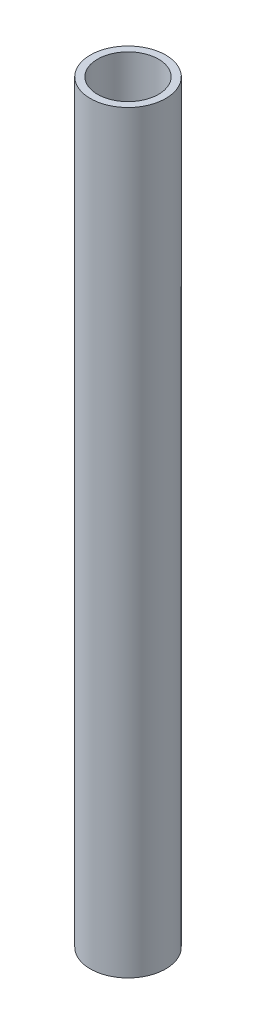
ISO-10303-21;
HEADER;
FILE_DESCRIPTION(('STEP AP214'),'2;1');
FILE_NAME('part.step','',(''),(''),'','','');
FILE_SCHEMA(('AUTOMOTIVE_DESIGN { 1 0 10303 214 1 1 1 1 }'));
ENDSEC;
DATA;
#1=APPLICATION_CONTEXT('core data for automotive mechanical design processes');
#2=APPLICATION_PROTOCOL_DEFINITION('international standard','automotive_design',2000,#1);
#3=PRODUCT_CONTEXT('',#1,'mechanical');
#4=PRODUCT('Part','Part','',(#3));
#5=PRODUCT_RELATED_PRODUCT_CATEGORY('part','',(#4));
#6=PRODUCT_DEFINITION_FORMATION('','',#4);
#7=PRODUCT_DEFINITION_CONTEXT('part definition',#1,'design');
#8=PRODUCT_DEFINITION('design','',#6,#7);
#9=PRODUCT_DEFINITION_SHAPE('','',#8);
#10=(LENGTH_UNIT() NAMED_UNIT(*) SI_UNIT(.MILLI.,.METRE.));
#11=(NAMED_UNIT(*) PLANE_ANGLE_UNIT() SI_UNIT($,.RADIAN.));
#12=(NAMED_UNIT(*) SI_UNIT($,.STERADIAN.) SOLID_ANGLE_UNIT());
#13=UNCERTAINTY_MEASURE_WITH_UNIT(LENGTH_MEASURE(1.E-05),#10,'distance_accuracy_value','');
#14=(GEOMETRIC_REPRESENTATION_CONTEXT(3) GLOBAL_UNCERTAINTY_ASSIGNED_CONTEXT((#13)) GLOBAL_UNIT_ASSIGNED_CONTEXT((#10,
#11,#12)) REPRESENTATION_CONTEXT('',''));
#15=CARTESIAN_POINT('',(0.,0.,0.));
#16=DIRECTION('',(0.,0.,1.));
#17=DIRECTION('',(1.,0.,0.));
#18=AXIS2_PLACEMENT_3D('',#15,#16,#17);
#19=CARTESIAN_POINT('',(0.,133.35,0.));
#20=DIRECTION('',(0.,-1.,0.));
#21=DIRECTION('',(0.,0.,-1.));
#22=AXIS2_PLACEMENT_3D('',#19,#20,#21);
#23=CYLINDRICAL_SURFACE('',#22,10.795);
#24=CARTESIAN_POINT('',(0.,-133.35,0.));
#25=DIRECTION('',(0.,-1.,0.));
#26=DIRECTION('',(0.,0.,-1.));
#27=AXIS2_PLACEMENT_3D('',#24,#25,#26);
#28=CIRCLE('',#27,10.795);
#29=CARTESIAN_POINT('',(0.,-133.35,-10.795));
#30=VERTEX_POINT('',#29);
#31=EDGE_CURVE('E27',#30,#30,#28,.T.);
#32=ORIENTED_EDGE('',*,*,#31,.T.);
#33=EDGE_LOOP('',(#32));
#34=FACE_BOUND('',#33,.T.);
#35=CARTESIAN_POINT('',(0.,133.35,0.));
#36=DIRECTION('',(0.,-1.,0.));
#37=DIRECTION('',(0.,0.,-1.));
#38=AXIS2_PLACEMENT_3D('',#35,#36,#37);
#39=CIRCLE('',#38,10.795);
#40=CARTESIAN_POINT('',(0.,133.35,-10.795));
#41=VERTEX_POINT('',#40);
#42=EDGE_CURVE('E18',#41,#41,#39,.T.);
#43=ORIENTED_EDGE('',*,*,#42,.F.);
#44=EDGE_LOOP('',(#43));
#45=FACE_BOUND('',#44,.T.);
#46=ADVANCED_FACE('F15',(#34,#45),#23,.F.);
#47=CARTESIAN_POINT('',(0.,133.35,0.));
#48=DIRECTION('',(0.,1.,0.));
#49=DIRECTION('',(0.,0.,1.));
#50=AXIS2_PLACEMENT_3D('',#47,#48,#49);
#51=PLANE('',#50);
#52=ORIENTED_EDGE('',*,*,#42,.T.);
#53=EDGE_LOOP('',(#52));
#54=FACE_BOUND('',#53,.T.);
#55=CARTESIAN_POINT('',(0.,133.35,0.));
#56=DIRECTION('',(0.,-1.,0.));
#57=DIRECTION('',(0.,0.,-1.));
#58=AXIS2_PLACEMENT_3D('',#55,#56,#57);
#59=CIRCLE('',#58,13.335);
#60=CARTESIAN_POINT('',(0.,133.35,-13.335));
#61=VERTEX_POINT('',#60);
#62=EDGE_CURVE('E22',#61,#61,#59,.T.);
#63=ORIENTED_EDGE('',*,*,#62,.F.);
#64=EDGE_LOOP('',(#63));
#65=FACE_BOUND('',#64,.T.);
#66=ADVANCED_FACE('F35',(#54,#65),#51,.T.);
#67=CARTESIAN_POINT('',(0.,-133.35,0.));
#68=DIRECTION('',(0.,1.,0.));
#69=DIRECTION('',(0.,0.,1.));
#70=AXIS2_PLACEMENT_3D('',#67,#68,#69);
#71=PLANE('',#70);
#72=ORIENTED_EDGE('',*,*,#31,.F.);
#73=EDGE_LOOP('',(#72));
#74=FACE_BOUND('',#73,.T.);
#75=CARTESIAN_POINT('',(0.,-133.35,0.));
#76=DIRECTION('',(0.,-1.,0.));
#77=DIRECTION('',(0.,0.,-1.));
#78=AXIS2_PLACEMENT_3D('',#75,#76,#77);
#79=CIRCLE('',#78,13.335);
#80=CARTESIAN_POINT('',(0.,-133.35,-13.335));
#81=VERTEX_POINT('',#80);
#82=EDGE_CURVE('E10',#81,#81,#79,.F.);
#83=ORIENTED_EDGE('',*,*,#82,.F.);
#84=EDGE_LOOP('',(#83));
#85=FACE_BOUND('',#84,.T.);
#86=ADVANCED_FACE('F43',(#74,#85),#71,.F.);
#87=CARTESIAN_POINT('',(0.,133.35,0.));
#88=DIRECTION('',(0.,-1.,0.));
#89=DIRECTION('',(0.,0.,-1.));
#90=AXIS2_PLACEMENT_3D('',#87,#88,#89);
#91=CYLINDRICAL_SURFACE('',#90,13.335);
#92=ORIENTED_EDGE('',*,*,#82,.T.);
#93=EDGE_LOOP('',(#92));
#94=FACE_BOUND('',#93,.T.);
#95=ORIENTED_EDGE('',*,*,#62,.T.);
#96=EDGE_LOOP('',(#95));
#97=FACE_BOUND('',#96,.T.);
#98=ADVANCED_FACE('F44',(#94,#97),#91,.T.);
#99=CLOSED_SHELL('',(#46,#66,#86,#98));
#100=MANIFOLD_SOLID_BREP('B1',#99);
#101=ADVANCED_BREP_SHAPE_REPRESENTATION('',(#18,#100),#14);
#102=SHAPE_DEFINITION_REPRESENTATION(#9,#101);
ENDSEC;
END-ISO-10303-21;
